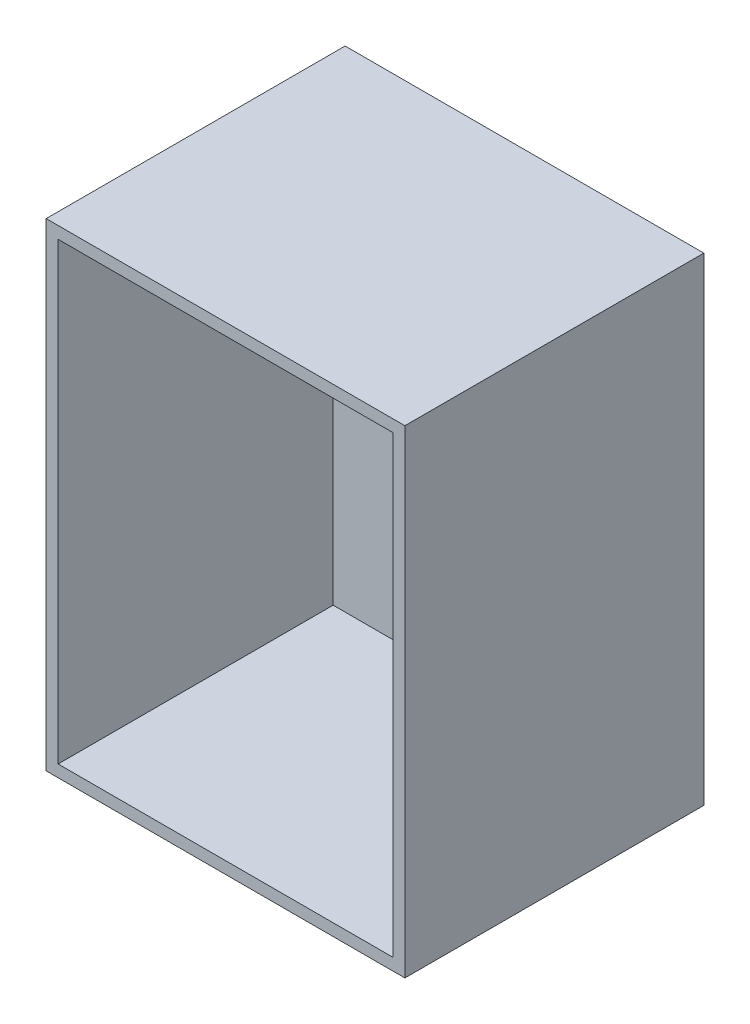
ISO-10303-21;
HEADER;
FILE_DESCRIPTION(('STEP AP214'),'2;1');
FILE_NAME('part.step','',(''),(''),'','','');
FILE_SCHEMA(('AUTOMOTIVE_DESIGN { 1 0 10303 214 1 1 1 1 }'));
ENDSEC;
DATA;
#1=APPLICATION_CONTEXT('core data for automotive mechanical design processes');
#2=APPLICATION_PROTOCOL_DEFINITION('international standard','automotive_design',2000,#1);
#3=PRODUCT_CONTEXT('',#1,'mechanical');
#4=PRODUCT('Part','Part','',(#3));
#5=PRODUCT_RELATED_PRODUCT_CATEGORY('part','',(#4));
#6=PRODUCT_DEFINITION_FORMATION('','',#4);
#7=PRODUCT_DEFINITION_CONTEXT('part definition',#1,'design');
#8=PRODUCT_DEFINITION('design','',#6,#7);
#9=PRODUCT_DEFINITION_SHAPE('','',#8);
#10=(LENGTH_UNIT() NAMED_UNIT(*) SI_UNIT(.MILLI.,.METRE.));
#11=(NAMED_UNIT(*) PLANE_ANGLE_UNIT() SI_UNIT($,.RADIAN.));
#12=(NAMED_UNIT(*) SI_UNIT($,.STERADIAN.) SOLID_ANGLE_UNIT());
#13=UNCERTAINTY_MEASURE_WITH_UNIT(LENGTH_MEASURE(1.E-05),#10,'distance_accuracy_value','');
#14=(GEOMETRIC_REPRESENTATION_CONTEXT(3) GLOBAL_UNCERTAINTY_ASSIGNED_CONTEXT((#13)) GLOBAL_UNIT_ASSIGNED_CONTEXT((#10,
#11,#12)) REPRESENTATION_CONTEXT('',''));
#15=CARTESIAN_POINT('',(0.,0.,0.));
#16=DIRECTION('',(0.,0.,1.));
#17=DIRECTION('',(1.,0.,0.));
#18=AXIS2_PLACEMENT_3D('',#15,#16,#17);
#19=CARTESIAN_POINT('',(0.,0.,25.));
#20=DIRECTION('',(0.,0.,1.));
#21=DIRECTION('',(1.,0.,0.));
#22=AXIS2_PLACEMENT_3D('',#19,#20,#21);
#23=PLANE('',#22);
#24=DIRECTION('',(0.,-1.,0.));
#25=VECTOR('',#24,1.);
#26=CARTESIAN_POINT('',(-17.1219512195122,3.58536585365854,25.));
#27=LINE('',#26,#25);
#28=CARTESIAN_POINT('',(-17.1219512195122,3.58536585365854,25.));
#29=VERTEX_POINT('',#28);
#30=CARTESIAN_POINT('',(-17.1219512195122,-36.4146341463415,25.));
#31=VERTEX_POINT('',#30);
#32=EDGE_CURVE('E156',#29,#31,#27,.T.);
#33=ORIENTED_EDGE('',*,*,#32,.T.);
#34=DIRECTION('',(1.,0.,0.));
#35=VECTOR('',#34,1.);
#36=CARTESIAN_POINT('',(-17.1219512195122,-36.4146341463415,25.));
#37=LINE('',#36,#35);
#38=CARTESIAN_POINT('',(12.8780487804878,-36.4146341463415,25.));
#39=VERTEX_POINT('',#38);
#40=EDGE_CURVE('E98',#31,#39,#37,.T.);
#41=ORIENTED_EDGE('',*,*,#40,.T.);
#42=DIRECTION('',(0.,1.,0.));
#43=VECTOR('',#42,1.);
#44=CARTESIAN_POINT('',(12.8780487804878,3.58536585365854,25.));
#45=LINE('',#44,#43);
#46=CARTESIAN_POINT('',(12.8780487804878,3.58536585365854,25.));
#47=VERTEX_POINT('',#46);
#48=EDGE_CURVE('E161',#39,#47,#45,.T.);
#49=ORIENTED_EDGE('',*,*,#48,.T.);
#50=DIRECTION('',(-1.,0.,0.));
#51=VECTOR('',#50,1.);
#52=CARTESIAN_POINT('',(-17.1219512195122,3.58536585365854,25.));
#53=LINE('',#52,#51);
#54=EDGE_CURVE('E70',#47,#29,#53,.T.);
#55=ORIENTED_EDGE('',*,*,#54,.T.);
#56=EDGE_LOOP('',(#33,#41,#49,#55));
#57=FACE_BOUND('',#56,.T.);
#58=DIRECTION('',(0.,-1.,0.));
#59=VECTOR('',#58,1.);
#60=CARTESIAN_POINT('',(-16.1219512195122,2.58536585365854,25.));
#61=LINE('',#60,#59);
#62=CARTESIAN_POINT('',(-16.1219512195122,2.58536585365854,25.));
#63=VERTEX_POINT('',#62);
#64=CARTESIAN_POINT('',(-16.1219512195122,-35.4146341463415,25.));
#65=VERTEX_POINT('',#64);
#66=EDGE_CURVE('E138',#63,#65,#61,.T.);
#67=ORIENTED_EDGE('',*,*,#66,.F.);
#68=DIRECTION('',(1.,0.,0.));
#69=VECTOR('',#68,1.);
#70=CARTESIAN_POINT('',(-16.1219512195122,2.58536585365854,25.));
#71=LINE('',#70,#69);
#72=CARTESIAN_POINT('',(11.8780487804878,2.58536585365854,25.));
#73=VERTEX_POINT('',#72);
#74=EDGE_CURVE('E61',#63,#73,#71,.T.);
#75=ORIENTED_EDGE('',*,*,#74,.T.);
#76=DIRECTION('',(0.,-1.,0.));
#77=VECTOR('',#76,1.);
#78=CARTESIAN_POINT('',(11.8780487804878,2.58536585365854,25.));
#79=LINE('',#78,#77);
#80=CARTESIAN_POINT('',(11.8780487804878,-35.4146341463415,25.));
#81=VERTEX_POINT('',#80);
#82=EDGE_CURVE('E142',#73,#81,#79,.T.);
#83=ORIENTED_EDGE('',*,*,#82,.T.);
#84=DIRECTION('',(1.,0.,0.));
#85=VECTOR('',#84,1.);
#86=CARTESIAN_POINT('',(-16.1219512195122,-35.4146341463415,25.));
#87=LINE('',#86,#85);
#88=EDGE_CURVE('E288',#65,#81,#87,.T.);
#89=ORIENTED_EDGE('',*,*,#88,.F.);
#90=EDGE_LOOP('',(#67,#75,#83,#89));
#91=FACE_BOUND('',#90,.T.);
#92=ADVANCED_FACE('F45',(#57,#91),#23,.T.);
#93=CARTESIAN_POINT('',(-17.1219512195122,3.58536585365854,25.));
#94=DIRECTION('',(1.,0.,0.));
#95=DIRECTION('',(0.,1.,0.));
#96=AXIS2_PLACEMENT_3D('',#93,#94,#95);
#97=PLANE('',#96);
#98=DIRECTION('',(0.,-1.,0.));
#99=VECTOR('',#98,1.);
#100=CARTESIAN_POINT('',(-17.1219512195122,3.58536585365854,0.));
#101=LINE('',#100,#99);
#102=CARTESIAN_POINT('',(-17.1219512195122,3.58536585365854,0.));
#103=VERTEX_POINT('',#102);
#104=CARTESIAN_POINT('',(-17.1219512195122,-36.4146341463415,0.));
#105=VERTEX_POINT('',#104);
#106=EDGE_CURVE('E144',#103,#105,#101,.T.);
#107=ORIENTED_EDGE('',*,*,#106,.T.);
#108=DIRECTION('',(0.,0.,-1.));
#109=VECTOR('',#108,1.);
#110=CARTESIAN_POINT('',(-17.1219512195122,-36.4146341463415,25.));
#111=LINE('',#110,#109);
#112=EDGE_CURVE('E11',#31,#105,#111,.T.);
#113=ORIENTED_EDGE('',*,*,#112,.F.);
#114=ORIENTED_EDGE('',*,*,#32,.F.);
#115=DIRECTION('',(0.,0.,-1.));
#116=VECTOR('',#115,1.);
#117=CARTESIAN_POINT('',(-17.1219512195122,3.58536585365854,25.));
#118=LINE('',#117,#116);
#119=EDGE_CURVE('E165',#29,#103,#118,.T.);
#120=ORIENTED_EDGE('',*,*,#119,.T.);
#121=EDGE_LOOP('',(#107,#113,#114,#120));
#122=FACE_BOUND('',#121,.T.);
#123=ADVANCED_FACE('F47',(#122),#97,.F.);
#124=CARTESIAN_POINT('',(-17.1219512195122,-36.4146341463415,25.));
#125=DIRECTION('',(0.,1.,0.));
#126=DIRECTION('',(0.,0.,1.));
#127=AXIS2_PLACEMENT_3D('',#124,#125,#126);
#128=PLANE('',#127);
#129=DIRECTION('',(1.,0.,0.));
#130=VECTOR('',#129,1.);
#131=CARTESIAN_POINT('',(-17.1219512195122,-36.4146341463415,0.));
#132=LINE('',#131,#130);
#133=CARTESIAN_POINT('',(12.8780487804878,-36.4146341463415,0.));
#134=VERTEX_POINT('',#133);
#135=EDGE_CURVE('E150',#105,#134,#132,.T.);
#136=ORIENTED_EDGE('',*,*,#135,.T.);
#137=DIRECTION('',(0.,0.,-1.));
#138=VECTOR('',#137,1.);
#139=CARTESIAN_POINT('',(12.8780487804878,-36.4146341463415,25.));
#140=LINE('',#139,#138);
#141=EDGE_CURVE('E54',#39,#134,#140,.T.);
#142=ORIENTED_EDGE('',*,*,#141,.F.);
#143=ORIENTED_EDGE('',*,*,#40,.F.);
#144=ORIENTED_EDGE('',*,*,#112,.T.);
#145=EDGE_LOOP('',(#136,#142,#143,#144));
#146=FACE_BOUND('',#145,.T.);
#147=ADVANCED_FACE('F199',(#146),#128,.F.);
#148=CARTESIAN_POINT('',(12.8780487804878,3.58536585365854,25.));
#149=DIRECTION('',(-1.,0.,0.));
#150=DIRECTION('',(0.,-1.,0.));
#151=AXIS2_PLACEMENT_3D('',#148,#149,#150);
#152=PLANE('',#151);
#153=DIRECTION('',(0.,1.,0.));
#154=VECTOR('',#153,1.);
#155=CARTESIAN_POINT('',(12.8780487804878,3.58536585365854,0.));
#156=LINE('',#155,#154);
#157=CARTESIAN_POINT('',(12.8780487804878,3.58536585365854,0.));
#158=VERTEX_POINT('',#157);
#159=EDGE_CURVE('E169',#134,#158,#156,.T.);
#160=ORIENTED_EDGE('',*,*,#159,.T.);
#161=DIRECTION('',(0.,0.,-1.));
#162=VECTOR('',#161,1.);
#163=CARTESIAN_POINT('',(12.8780487804878,3.58536585365854,25.));
#164=LINE('',#163,#162);
#165=EDGE_CURVE('E176',#47,#158,#164,.T.);
#166=ORIENTED_EDGE('',*,*,#165,.F.);
#167=ORIENTED_EDGE('',*,*,#48,.F.);
#168=ORIENTED_EDGE('',*,*,#141,.T.);
#169=EDGE_LOOP('',(#160,#166,#167,#168));
#170=FACE_BOUND('',#169,.T.);
#171=ADVANCED_FACE('F183',(#170),#152,.F.);
#172=CARTESIAN_POINT('',(-17.1219512195122,3.58536585365854,25.));
#173=DIRECTION('',(0.,-1.,0.));
#174=DIRECTION('',(0.,0.,-1.));
#175=AXIS2_PLACEMENT_3D('',#172,#173,#174);
#176=PLANE('',#175);
#177=DIRECTION('',(-1.,0.,0.));
#178=VECTOR('',#177,1.);
#179=CARTESIAN_POINT('',(-17.1219512195122,3.58536585365854,0.));
#180=LINE('',#179,#178);
#181=EDGE_CURVE('E91',#158,#103,#180,.T.);
#182=ORIENTED_EDGE('',*,*,#181,.T.);
#183=ORIENTED_EDGE('',*,*,#119,.F.);
#184=ORIENTED_EDGE('',*,*,#54,.F.);
#185=ORIENTED_EDGE('',*,*,#165,.T.);
#186=EDGE_LOOP('',(#182,#183,#184,#185));
#187=FACE_BOUND('',#186,.T.);
#188=ADVANCED_FACE('F191',(#187),#176,.F.);
#189=CARTESIAN_POINT('',(0.,0.,0.));
#190=DIRECTION('',(0.,0.,1.));
#191=DIRECTION('',(1.,0.,0.));
#192=AXIS2_PLACEMENT_3D('',#189,#190,#191);
#193=PLANE('',#192);
#194=ORIENTED_EDGE('',*,*,#106,.F.);
#195=ORIENTED_EDGE('',*,*,#181,.F.);
#196=ORIENTED_EDGE('',*,*,#159,.F.);
#197=ORIENTED_EDGE('',*,*,#135,.F.);
#198=EDGE_LOOP('',(#194,#195,#196,#197));
#199=FACE_BOUND('',#198,.T.);
#200=ADVANCED_FACE('F187',(#199),#193,.F.);
#201=CARTESIAN_POINT('',(-16.1219512195122,2.58536585365854,2.));
#202=DIRECTION('',(0.,-1.,0.));
#203=DIRECTION('',(0.,0.,-1.));
#204=AXIS2_PLACEMENT_3D('',#201,#202,#203);
#205=PLANE('',#204);
#206=ORIENTED_EDGE('',*,*,#74,.F.);
#207=DIRECTION('',(0.,0.,1.));
#208=VECTOR('',#207,1.);
#209=CARTESIAN_POINT('',(-16.1219512195122,2.58536585365854,2.));
#210=LINE('',#209,#208);
#211=CARTESIAN_POINT('',(-16.1219512195122,2.58536585365854,2.));
#212=VERTEX_POINT('',#211);
#213=EDGE_CURVE('E136',#212,#63,#210,.T.);
#214=ORIENTED_EDGE('',*,*,#213,.F.);
#215=DIRECTION('',(1.,0.,0.));
#216=VECTOR('',#215,1.);
#217=CARTESIAN_POINT('',(-16.1219512195122,2.58536585365854,2.));
#218=LINE('',#217,#216);
#219=CARTESIAN_POINT('',(11.8780487804878,2.58536585365854,2.));
#220=VERTEX_POINT('',#219);
#221=EDGE_CURVE('E125',#212,#220,#218,.T.);
#222=ORIENTED_EDGE('',*,*,#221,.T.);
#223=DIRECTION('',(0.,0.,1.));
#224=VECTOR('',#223,1.);
#225=CARTESIAN_POINT('',(11.8780487804878,2.58536585365854,2.));
#226=LINE('',#225,#224);
#227=EDGE_CURVE('E135',#220,#73,#226,.T.);
#228=ORIENTED_EDGE('',*,*,#227,.T.);
#229=EDGE_LOOP('',(#206,#214,#222,#228));
#230=FACE_BOUND('',#229,.T.);
#231=ADVANCED_FACE('F134',(#230),#205,.T.);
#232=CARTESIAN_POINT('',(11.8780487804878,2.58536585365854,2.));
#233=DIRECTION('',(-1.,0.,0.));
#234=DIRECTION('',(0.,0.,1.));
#235=AXIS2_PLACEMENT_3D('',#232,#233,#234);
#236=PLANE('',#235);
#237=ORIENTED_EDGE('',*,*,#82,.F.);
#238=ORIENTED_EDGE('',*,*,#227,.F.);
#239=DIRECTION('',(0.,-1.,0.));
#240=VECTOR('',#239,1.);
#241=CARTESIAN_POINT('',(11.8780487804878,2.58536585365854,2.));
#242=LINE('',#241,#240);
#243=CARTESIAN_POINT('',(11.8780487804878,-35.4146341463415,2.));
#244=VERTEX_POINT('',#243);
#245=EDGE_CURVE('E121',#220,#244,#242,.T.);
#246=ORIENTED_EDGE('',*,*,#245,.T.);
#247=DIRECTION('',(0.,0.,1.));
#248=VECTOR('',#247,1.);
#249=CARTESIAN_POINT('',(11.8780487804878,-35.4146341463415,2.));
#250=LINE('',#249,#248);
#251=EDGE_CURVE('E145',#244,#81,#250,.T.);
#252=ORIENTED_EDGE('',*,*,#251,.T.);
#253=EDGE_LOOP('',(#237,#238,#246,#252));
#254=FACE_BOUND('',#253,.T.);
#255=ADVANCED_FACE('F140',(#254),#236,.T.);
#256=CARTESIAN_POINT('',(-16.1219512195122,-35.4146341463415,2.));
#257=DIRECTION('',(0.,-1.,0.));
#258=DIRECTION('',(0.,0.,-1.));
#259=AXIS2_PLACEMENT_3D('',#256,#257,#258);
#260=PLANE('',#259);
#261=ORIENTED_EDGE('',*,*,#88,.T.);
#262=ORIENTED_EDGE('',*,*,#251,.F.);
#263=DIRECTION('',(1.,0.,0.));
#264=VECTOR('',#263,1.);
#265=CARTESIAN_POINT('',(-16.1219512195122,-35.4146341463415,2.));
#266=LINE('',#265,#264);
#267=CARTESIAN_POINT('',(-16.1219512195122,-35.4146341463415,2.));
#268=VERTEX_POINT('',#267);
#269=EDGE_CURVE('E128',#268,#244,#266,.T.);
#270=ORIENTED_EDGE('',*,*,#269,.F.);
#271=DIRECTION('',(0.,0.,1.));
#272=VECTOR('',#271,1.);
#273=CARTESIAN_POINT('',(-16.1219512195122,-35.4146341463415,2.));
#274=LINE('',#273,#272);
#275=EDGE_CURVE('E152',#268,#65,#274,.T.);
#276=ORIENTED_EDGE('',*,*,#275,.T.);
#277=EDGE_LOOP('',(#261,#262,#270,#276));
#278=FACE_BOUND('',#277,.T.);
#279=ADVANCED_FACE('F212',(#278),#260,.F.);
#280=CARTESIAN_POINT('',(-16.1219512195122,2.58536585365854,2.));
#281=DIRECTION('',(-1.,0.,0.));
#282=DIRECTION('',(0.,0.,1.));
#283=AXIS2_PLACEMENT_3D('',#280,#281,#282);
#284=PLANE('',#283);
#285=ORIENTED_EDGE('',*,*,#66,.T.);
#286=ORIENTED_EDGE('',*,*,#275,.F.);
#287=DIRECTION('',(0.,-1.,0.));
#288=VECTOR('',#287,1.);
#289=CARTESIAN_POINT('',(-16.1219512195122,2.58536585365854,2.));
#290=LINE('',#289,#288);
#291=EDGE_CURVE('E298',#212,#268,#290,.T.);
#292=ORIENTED_EDGE('',*,*,#291,.F.);
#293=ORIENTED_EDGE('',*,*,#213,.T.);
#294=EDGE_LOOP('',(#285,#286,#292,#293));
#295=FACE_BOUND('',#294,.T.);
#296=ADVANCED_FACE('F215',(#295),#284,.F.);
#297=CARTESIAN_POINT('',(0.,0.,2.));
#298=DIRECTION('',(0.,0.,-1.));
#299=DIRECTION('',(-1.,0.,0.));
#300=AXIS2_PLACEMENT_3D('',#297,#298,#299);
#301=PLANE('',#300);
#302=ORIENTED_EDGE('',*,*,#221,.F.);
#303=ORIENTED_EDGE('',*,*,#291,.T.);
#304=ORIENTED_EDGE('',*,*,#269,.T.);
#305=ORIENTED_EDGE('',*,*,#245,.F.);
#306=EDGE_LOOP('',(#302,#303,#304,#305));
#307=FACE_BOUND('',#306,.T.);
#308=ADVANCED_FACE('F123',(#307),#301,.F.);
#309=CLOSED_SHELL('',(#92,#123,#147,#171,#188,#200,#231,#255,#279,#296,#308));
#310=MANIFOLD_SOLID_BREP('B2',#309);
#311=ADVANCED_BREP_SHAPE_REPRESENTATION('',(#18,#310),#14);
#312=SHAPE_DEFINITION_REPRESENTATION(#9,#311);
ENDSEC;
END-ISO-10303-21;
